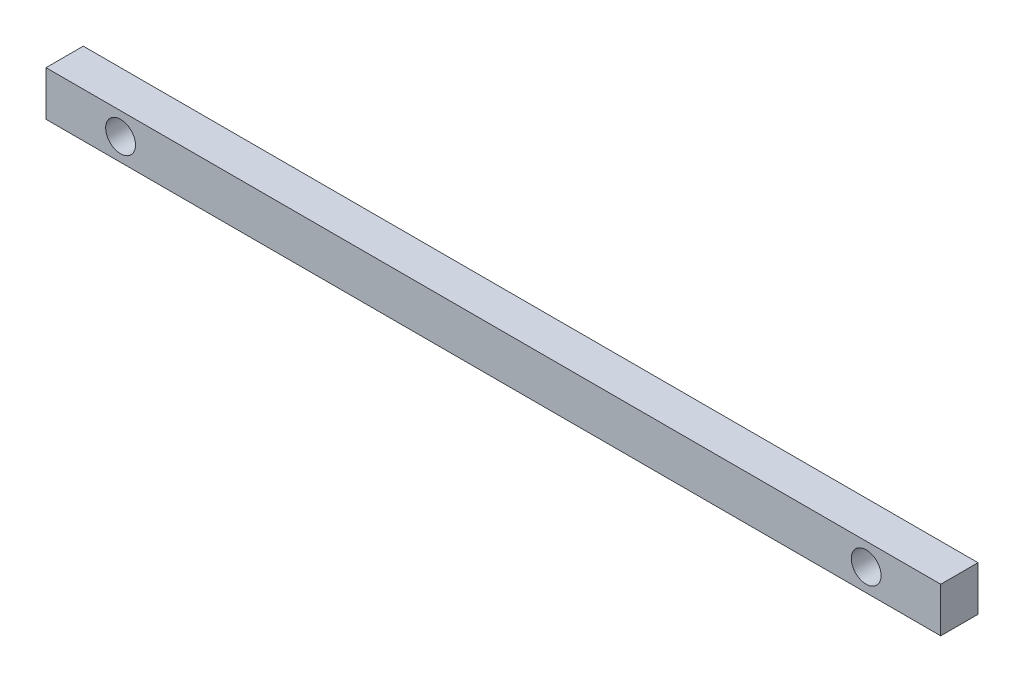
ISO-10303-21;
HEADER;
FILE_DESCRIPTION(('STEP AP214'),'2;1');
FILE_NAME('part.step','',(''),(''),'','','');
FILE_SCHEMA(('AUTOMOTIVE_DESIGN { 1 0 10303 214 1 1 1 1 }'));
ENDSEC;
DATA;
#1=APPLICATION_CONTEXT('core data for automotive mechanical design processes');
#2=APPLICATION_PROTOCOL_DEFINITION('international standard','automotive_design',2000,#1);
#3=PRODUCT_CONTEXT('',#1,'mechanical');
#4=PRODUCT('Part','Part','',(#3));
#5=PRODUCT_RELATED_PRODUCT_CATEGORY('part','',(#4));
#6=PRODUCT_DEFINITION_FORMATION('','',#4);
#7=PRODUCT_DEFINITION_CONTEXT('part definition',#1,'design');
#8=PRODUCT_DEFINITION('design','',#6,#7);
#9=PRODUCT_DEFINITION_SHAPE('','',#8);
#10=(LENGTH_UNIT() NAMED_UNIT(*) SI_UNIT(.MILLI.,.METRE.));
#11=(NAMED_UNIT(*) PLANE_ANGLE_UNIT() SI_UNIT($,.RADIAN.));
#12=(NAMED_UNIT(*) SI_UNIT($,.STERADIAN.) SOLID_ANGLE_UNIT());
#13=UNCERTAINTY_MEASURE_WITH_UNIT(LENGTH_MEASURE(1.E-05),#10,'distance_accuracy_value','');
#14=(GEOMETRIC_REPRESENTATION_CONTEXT(3) GLOBAL_UNCERTAINTY_ASSIGNED_CONTEXT((#13)) GLOBAL_UNIT_ASSIGNED_CONTEXT((#10,
#11,#12)) REPRESENTATION_CONTEXT('',''));
#15=CARTESIAN_POINT('',(0.,0.,0.));
#16=DIRECTION('',(0.,0.,1.));
#17=DIRECTION('',(1.,0.,0.));
#18=AXIS2_PLACEMENT_3D('',#15,#16,#17);
#19=CARTESIAN_POINT('',(0.,0.,5.));
#20=DIRECTION('',(0.,0.,-1.));
#21=DIRECTION('',(-1.,0.,0.));
#22=AXIS2_PLACEMENT_3D('',#19,#20,#21);
#23=PLANE('',#22);
#24=CARTESIAN_POINT('',(-50.,0.,5.));
#25=DIRECTION('',(0.,0.,1.));
#26=DIRECTION('',(1.,0.,0.));
#27=AXIS2_PLACEMENT_3D('',#24,#25,#26);
#28=CIRCLE('',#27,2.);
#29=CARTESIAN_POINT('',(-48.,0.,5.));
#30=VERTEX_POINT('',#29);
#31=EDGE_CURVE('E100',#30,#30,#28,.T.);
#32=ORIENTED_EDGE('',*,*,#31,.F.);
#33=EDGE_LOOP('',(#32));
#34=FACE_BOUND('',#33,.T.);
#35=DIRECTION('',(0.,1.,0.));
#36=VECTOR('',#35,1.);
#37=CARTESIAN_POINT('',(60.,-3.,5.));
#38=LINE('',#37,#36);
#39=CARTESIAN_POINT('',(60.,-3.,5.));
#40=VERTEX_POINT('',#39);
#41=CARTESIAN_POINT('',(60.,3.,5.));
#42=VERTEX_POINT('',#41);
#43=EDGE_CURVE('E85',#40,#42,#38,.T.);
#44=ORIENTED_EDGE('',*,*,#43,.T.);
#45=DIRECTION('',(-1.,0.,0.));
#46=VECTOR('',#45,1.);
#47=CARTESIAN_POINT('',(-60.,3.,5.));
#48=LINE('',#47,#46);
#49=CARTESIAN_POINT('',(-60.,3.,5.));
#50=VERTEX_POINT('',#49);
#51=EDGE_CURVE('E80',#42,#50,#48,.T.);
#52=ORIENTED_EDGE('',*,*,#51,.T.);
#53=DIRECTION('',(0.,-1.,0.));
#54=VECTOR('',#53,1.);
#55=CARTESIAN_POINT('',(-60.,-3.,5.));
#56=LINE('',#55,#54);
#57=CARTESIAN_POINT('',(-60.,-3.,5.));
#58=VERTEX_POINT('',#57);
#59=EDGE_CURVE('E83',#50,#58,#56,.T.);
#60=ORIENTED_EDGE('',*,*,#59,.T.);
#61=DIRECTION('',(1.,0.,0.));
#62=VECTOR('',#61,1.);
#63=CARTESIAN_POINT('',(-60.,-3.,5.));
#64=LINE('',#63,#62);
#65=EDGE_CURVE('E50',#58,#40,#64,.T.);
#66=ORIENTED_EDGE('',*,*,#65,.T.);
#67=EDGE_LOOP('',(#44,#52,#60,#66));
#68=FACE_BOUND('',#67,.T.);
#69=CARTESIAN_POINT('',(50.,0.,5.));
#70=DIRECTION('',(0.,0.,1.));
#71=DIRECTION('',(1.,0.,0.));
#72=AXIS2_PLACEMENT_3D('',#69,#70,#71);
#73=CIRCLE('',#72,2.);
#74=CARTESIAN_POINT('',(52.,0.,5.));
#75=VERTEX_POINT('',#74);
#76=EDGE_CURVE('E115',#75,#75,#73,.T.);
#77=ORIENTED_EDGE('',*,*,#76,.F.);
#78=EDGE_LOOP('',(#77));
#79=FACE_BOUND('',#78,.T.);
#80=ADVANCED_FACE('F33',(#34,#68,#79),#23,.F.);
#81=CARTESIAN_POINT('',(0.,0.,0.));
#82=DIRECTION('',(0.,0.,-1.));
#83=DIRECTION('',(-1.,0.,0.));
#84=AXIS2_PLACEMENT_3D('',#81,#82,#83);
#85=PLANE('',#84);
#86=CARTESIAN_POINT('',(-50.,0.,0.));
#87=DIRECTION('',(0.,0.,1.));
#88=DIRECTION('',(1.,0.,0.));
#89=AXIS2_PLACEMENT_3D('',#86,#87,#88);
#90=CIRCLE('',#89,2.);
#91=CARTESIAN_POINT('',(-48.,0.,0.));
#92=VERTEX_POINT('',#91);
#93=EDGE_CURVE('E112',#92,#92,#90,.T.);
#94=ORIENTED_EDGE('',*,*,#93,.T.);
#95=EDGE_LOOP('',(#94));
#96=FACE_BOUND('',#95,.T.);
#97=DIRECTION('',(0.,1.,0.));
#98=VECTOR('',#97,1.);
#99=CARTESIAN_POINT('',(60.,-3.,0.));
#100=LINE('',#99,#98);
#101=CARTESIAN_POINT('',(60.,-3.,0.));
#102=VERTEX_POINT('',#101);
#103=CARTESIAN_POINT('',(60.,3.,0.));
#104=VERTEX_POINT('',#103);
#105=EDGE_CURVE('E97',#102,#104,#100,.T.);
#106=ORIENTED_EDGE('',*,*,#105,.F.);
#107=DIRECTION('',(1.,0.,0.));
#108=VECTOR('',#107,1.);
#109=CARTESIAN_POINT('',(-60.,-3.,0.));
#110=LINE('',#109,#108);
#111=CARTESIAN_POINT('',(-60.,-3.,0.));
#112=VERTEX_POINT('',#111);
#113=EDGE_CURVE('E73',#112,#102,#110,.T.);
#114=ORIENTED_EDGE('',*,*,#113,.F.);
#115=DIRECTION('',(0.,-1.,0.));
#116=VECTOR('',#115,1.);
#117=CARTESIAN_POINT('',(-60.,-3.,0.));
#118=LINE('',#117,#116);
#119=CARTESIAN_POINT('',(-60.,3.,0.));
#120=VERTEX_POINT('',#119);
#121=EDGE_CURVE('E67',#120,#112,#118,.T.);
#122=ORIENTED_EDGE('',*,*,#121,.F.);
#123=DIRECTION('',(-1.,0.,0.));
#124=VECTOR('',#123,1.);
#125=CARTESIAN_POINT('',(-60.,3.,0.));
#126=LINE('',#125,#124);
#127=EDGE_CURVE('E89',#104,#120,#126,.T.);
#128=ORIENTED_EDGE('',*,*,#127,.F.);
#129=EDGE_LOOP('',(#106,#114,#122,#128));
#130=FACE_BOUND('',#129,.T.);
#131=CARTESIAN_POINT('',(50.,0.,0.));
#132=DIRECTION('',(0.,0.,1.));
#133=DIRECTION('',(1.,0.,0.));
#134=AXIS2_PLACEMENT_3D('',#131,#132,#133);
#135=CIRCLE('',#134,2.);
#136=CARTESIAN_POINT('',(52.,0.,0.));
#137=VERTEX_POINT('',#136);
#138=EDGE_CURVE('E118',#137,#137,#135,.T.);
#139=ORIENTED_EDGE('',*,*,#138,.T.);
#140=EDGE_LOOP('',(#139));
#141=FACE_BOUND('',#140,.T.);
#142=ADVANCED_FACE('F108',(#96,#130,#141),#85,.T.);
#143=CARTESIAN_POINT('',(60.,-3.,5.));
#144=DIRECTION('',(-1.,0.,0.));
#145=DIRECTION('',(0.,0.,1.));
#146=AXIS2_PLACEMENT_3D('',#143,#144,#145);
#147=PLANE('',#146);
#148=ORIENTED_EDGE('',*,*,#105,.T.);
#149=DIRECTION('',(0.,0.,-1.));
#150=VECTOR('',#149,1.);
#151=CARTESIAN_POINT('',(60.,3.,5.));
#152=LINE('',#151,#150);
#153=EDGE_CURVE('E11',#42,#104,#152,.T.);
#154=ORIENTED_EDGE('',*,*,#153,.F.);
#155=ORIENTED_EDGE('',*,*,#43,.F.);
#156=DIRECTION('',(0.,0.,-1.));
#157=VECTOR('',#156,1.);
#158=CARTESIAN_POINT('',(60.,-3.,5.));
#159=LINE('',#158,#157);
#160=EDGE_CURVE('E93',#40,#102,#159,.T.);
#161=ORIENTED_EDGE('',*,*,#160,.T.);
#162=EDGE_LOOP('',(#148,#154,#155,#161));
#163=FACE_BOUND('',#162,.T.);
#164=ADVANCED_FACE('F35',(#163),#147,.F.);
#165=CARTESIAN_POINT('',(-60.,3.,5.));
#166=DIRECTION('',(0.,-1.,0.));
#167=DIRECTION('',(0.,0.,-1.));
#168=AXIS2_PLACEMENT_3D('',#165,#166,#167);
#169=PLANE('',#168);
#170=ORIENTED_EDGE('',*,*,#127,.T.);
#171=DIRECTION('',(0.,0.,-1.));
#172=VECTOR('',#171,1.);
#173=CARTESIAN_POINT('',(-60.,3.,5.));
#174=LINE('',#173,#172);
#175=EDGE_CURVE('E42',#50,#120,#174,.T.);
#176=ORIENTED_EDGE('',*,*,#175,.F.);
#177=ORIENTED_EDGE('',*,*,#51,.F.);
#178=ORIENTED_EDGE('',*,*,#153,.T.);
#179=EDGE_LOOP('',(#170,#176,#177,#178));
#180=FACE_BOUND('',#179,.T.);
#181=ADVANCED_FACE('F88',(#180),#169,.F.);
#182=CARTESIAN_POINT('',(-60.,-3.,5.));
#183=DIRECTION('',(1.,0.,0.));
#184=DIRECTION('',(0.,0.,-1.));
#185=AXIS2_PLACEMENT_3D('',#182,#183,#184);
#186=PLANE('',#185);
#187=ORIENTED_EDGE('',*,*,#121,.T.);
#188=DIRECTION('',(0.,0.,-1.));
#189=VECTOR('',#188,1.);
#190=CARTESIAN_POINT('',(-60.,-3.,5.));
#191=LINE('',#190,#189);
#192=EDGE_CURVE('E90',#58,#112,#191,.T.);
#193=ORIENTED_EDGE('',*,*,#192,.F.);
#194=ORIENTED_EDGE('',*,*,#59,.F.);
#195=ORIENTED_EDGE('',*,*,#175,.T.);
#196=EDGE_LOOP('',(#187,#193,#194,#195));
#197=FACE_BOUND('',#196,.T.);
#198=ADVANCED_FACE('F91',(#197),#186,.F.);
#199=CARTESIAN_POINT('',(-60.,-3.,5.));
#200=DIRECTION('',(0.,1.,0.));
#201=DIRECTION('',(0.,0.,1.));
#202=AXIS2_PLACEMENT_3D('',#199,#200,#201);
#203=PLANE('',#202);
#204=ORIENTED_EDGE('',*,*,#113,.T.);
#205=ORIENTED_EDGE('',*,*,#160,.F.);
#206=ORIENTED_EDGE('',*,*,#65,.F.);
#207=ORIENTED_EDGE('',*,*,#192,.T.);
#208=EDGE_LOOP('',(#204,#205,#206,#207));
#209=FACE_BOUND('',#208,.T.);
#210=ADVANCED_FACE('F105',(#209),#203,.F.);
#211=CARTESIAN_POINT('',(-50.,0.,5.));
#212=DIRECTION('',(0.,0.,-1.));
#213=DIRECTION('',(-1.,0.,0.));
#214=AXIS2_PLACEMENT_3D('',#211,#212,#213);
#215=CYLINDRICAL_SURFACE('',#214,2.);
#216=ORIENTED_EDGE('',*,*,#31,.T.);
#217=EDGE_LOOP('',(#216));
#218=FACE_BOUND('',#217,.T.);
#219=ORIENTED_EDGE('',*,*,#93,.F.);
#220=EDGE_LOOP('',(#219));
#221=FACE_BOUND('',#220,.T.);
#222=ADVANCED_FACE('F136',(#218,#221),#215,.F.);
#223=CARTESIAN_POINT('',(50.,0.,5.));
#224=DIRECTION('',(0.,0.,-1.));
#225=DIRECTION('',(-1.,0.,0.));
#226=AXIS2_PLACEMENT_3D('',#223,#224,#225);
#227=CYLINDRICAL_SURFACE('',#226,2.);
#228=ORIENTED_EDGE('',*,*,#76,.T.);
#229=EDGE_LOOP('',(#228));
#230=FACE_BOUND('',#229,.T.);
#231=ORIENTED_EDGE('',*,*,#138,.F.);
#232=EDGE_LOOP('',(#231));
#233=FACE_BOUND('',#232,.T.);
#234=ADVANCED_FACE('F124',(#230,#233),#227,.F.);
#235=CLOSED_SHELL('',(#80,#142,#164,#181,#198,#210,#222,#234));
#236=MANIFOLD_SOLID_BREP('B2',#235);
#237=ADVANCED_BREP_SHAPE_REPRESENTATION('',(#18,#236),#14);
#238=SHAPE_DEFINITION_REPRESENTATION(#9,#237);
ENDSEC;
END-ISO-10303-21;
